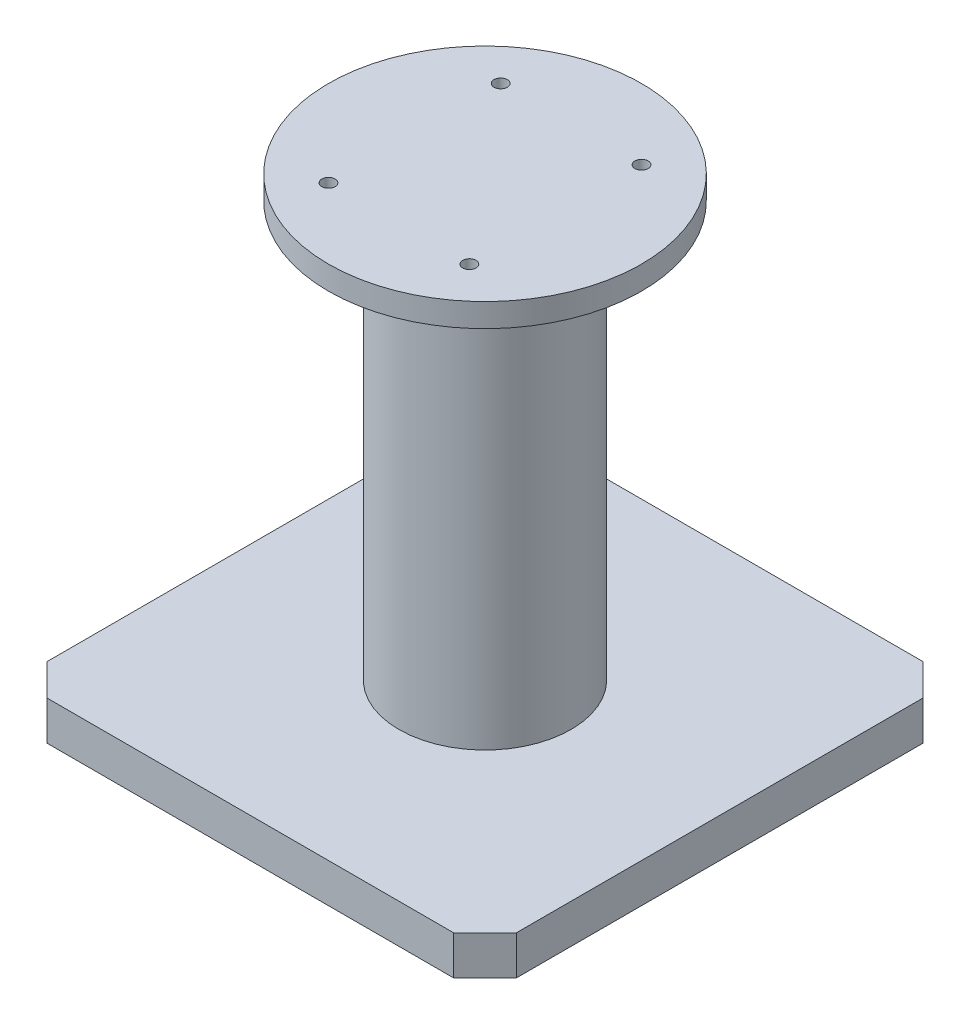
ISO-10303-21;
HEADER;
FILE_DESCRIPTION(('STEP AP214'),'2;1');
FILE_NAME('part.step','',(''),(''),'','','');
FILE_SCHEMA(('AUTOMOTIVE_DESIGN { 1 0 10303 214 1 1 1 1 }'));
ENDSEC;
DATA;
#1=APPLICATION_CONTEXT('core data for automotive mechanical design processes');
#2=APPLICATION_PROTOCOL_DEFINITION('international standard','automotive_design',2000,#1);
#3=PRODUCT_CONTEXT('',#1,'mechanical');
#4=PRODUCT('Part','Part','',(#3));
#5=PRODUCT_RELATED_PRODUCT_CATEGORY('part','',(#4));
#6=PRODUCT_DEFINITION_FORMATION('','',#4);
#7=PRODUCT_DEFINITION_CONTEXT('part definition',#1,'design');
#8=PRODUCT_DEFINITION('design','',#6,#7);
#9=PRODUCT_DEFINITION_SHAPE('','',#8);
#10=(LENGTH_UNIT() NAMED_UNIT(*) SI_UNIT(.MILLI.,.METRE.));
#11=(NAMED_UNIT(*) PLANE_ANGLE_UNIT() SI_UNIT($,.RADIAN.));
#12=(NAMED_UNIT(*) SI_UNIT($,.STERADIAN.) SOLID_ANGLE_UNIT());
#13=UNCERTAINTY_MEASURE_WITH_UNIT(LENGTH_MEASURE(1.E-05),#10,'distance_accuracy_value','');
#14=(GEOMETRIC_REPRESENTATION_CONTEXT(3) GLOBAL_UNCERTAINTY_ASSIGNED_CONTEXT((#13)) GLOBAL_UNIT_ASSIGNED_CONTEXT((#10,
#11,#12)) REPRESENTATION_CONTEXT('',''));
#15=CARTESIAN_POINT('',(0.,0.,0.));
#16=DIRECTION('',(0.,0.,1.));
#17=DIRECTION('',(1.,0.,0.));
#18=AXIS2_PLACEMENT_3D('',#15,#16,#17);
#19=CARTESIAN_POINT('',(0.,305.,0.));
#20=DIRECTION('',(0.,1.,0.));
#21=DIRECTION('',(0.,0.,1.));
#22=AXIS2_PLACEMENT_3D('',#19,#20,#21);
#23=PLANE('',#22);
#24=CARTESIAN_POINT('',(-45.,305.,55.));
#25=DIRECTION('',(0.,-1.,0.));
#26=DIRECTION('',(0.,0.,-1.));
#27=AXIS2_PLACEMENT_3D('',#24,#25,#26);
#28=CIRCLE('',#27,4.25000000000001);
#29=CARTESIAN_POINT('',(-45.,305.,50.75));
#30=VERTEX_POINT('',#29);
#31=EDGE_CURVE('E246',#30,#30,#28,.T.);
#32=ORIENTED_EDGE('',*,*,#31,.T.);
#33=EDGE_LOOP('',(#32));
#34=FACE_BOUND('',#33,.T.);
#35=CARTESIAN_POINT('',(-45.,305.,-55.));
#36=DIRECTION('',(0.,1.,0.));
#37=DIRECTION('',(0.,0.,1.));
#38=AXIS2_PLACEMENT_3D('',#35,#36,#37);
#39=CIRCLE('',#38,4.25000000000001);
#40=CARTESIAN_POINT('',(-45.,305.,-50.75));
#41=VERTEX_POINT('',#40);
#42=EDGE_CURVE('E230',#41,#41,#39,.T.);
#43=ORIENTED_EDGE('',*,*,#42,.F.);
#44=EDGE_LOOP('',(#43));
#45=FACE_BOUND('',#44,.T.);
#46=CARTESIAN_POINT('',(45.,305.,55.));
#47=DIRECTION('',(0.,1.,0.));
#48=DIRECTION('',(0.,0.,1.));
#49=AXIS2_PLACEMENT_3D('',#46,#47,#48);
#50=CIRCLE('',#49,4.25000000000001);
#51=CARTESIAN_POINT('',(45.,305.,59.25));
#52=VERTEX_POINT('',#51);
#53=EDGE_CURVE('E226',#52,#52,#50,.T.);
#54=ORIENTED_EDGE('',*,*,#53,.F.);
#55=EDGE_LOOP('',(#54));
#56=FACE_BOUND('',#55,.T.);
#57=CARTESIAN_POINT('',(0.,305.,0.));
#58=DIRECTION('',(0.,1.,0.));
#59=DIRECTION('',(0.,0.,1.));
#60=AXIS2_PLACEMENT_3D('',#57,#58,#59);
#61=CIRCLE('',#60,100.);
#62=CARTESIAN_POINT('',(0.,305.,100.));
#63=VERTEX_POINT('',#62);
#64=EDGE_CURVE('E217',#63,#63,#61,.T.);
#65=ORIENTED_EDGE('',*,*,#64,.T.);
#66=EDGE_LOOP('',(#65));
#67=FACE_BOUND('',#66,.T.);
#68=CARTESIAN_POINT('',(45.,305.,-55.));
#69=DIRECTION('',(0.,-1.,0.));
#70=DIRECTION('',(0.,0.,-1.));
#71=AXIS2_PLACEMENT_3D('',#68,#69,#70);
#72=CIRCLE('',#71,4.25000000000001);
#73=CARTESIAN_POINT('',(45.,305.,-59.25));
#74=VERTEX_POINT('',#73);
#75=EDGE_CURVE('E238',#74,#74,#72,.T.);
#76=ORIENTED_EDGE('',*,*,#75,.T.);
#77=EDGE_LOOP('',(#76));
#78=FACE_BOUND('',#77,.T.);
#79=ADVANCED_FACE('F39',(#34,#45,#56,#67,#78),#23,.T.);
#80=CARTESIAN_POINT('',(0.,290.,0.));
#81=DIRECTION('',(0.,1.,0.));
#82=DIRECTION('',(0.,0.,1.));
#83=AXIS2_PLACEMENT_3D('',#80,#81,#82);
#84=PLANE('',#83);
#85=CARTESIAN_POINT('',(-45.,290.,-55.));
#86=DIRECTION('',(0.,1.,0.));
#87=DIRECTION('',(0.,0.,1.));
#88=AXIS2_PLACEMENT_3D('',#85,#86,#87);
#89=CIRCLE('',#88,4.25000000000001);
#90=CARTESIAN_POINT('',(-45.,290.,-50.75));
#91=VERTEX_POINT('',#90);
#92=EDGE_CURVE('E250',#91,#91,#89,.T.);
#93=ORIENTED_EDGE('',*,*,#92,.T.);
#94=EDGE_LOOP('',(#93));
#95=FACE_BOUND('',#94,.T.);
#96=CARTESIAN_POINT('',(45.,290.,55.));
#97=DIRECTION('',(0.,1.,0.));
#98=DIRECTION('',(0.,0.,1.));
#99=AXIS2_PLACEMENT_3D('',#96,#97,#98);
#100=CIRCLE('',#99,4.25000000000001);
#101=CARTESIAN_POINT('',(45.,290.,59.25));
#102=VERTEX_POINT('',#101);
#103=EDGE_CURVE('E222',#102,#102,#100,.T.);
#104=ORIENTED_EDGE('',*,*,#103,.T.);
#105=EDGE_LOOP('',(#104));
#106=FACE_BOUND('',#105,.T.);
#107=CARTESIAN_POINT('',(0.,290.,0.));
#108=DIRECTION('',(0.,1.,0.));
#109=DIRECTION('',(0.,0.,1.));
#110=AXIS2_PLACEMENT_3D('',#107,#108,#109);
#111=CIRCLE('',#110,55.);
#112=CARTESIAN_POINT('',(0.,290.,55.));
#113=VERTEX_POINT('',#112);
#114=EDGE_CURVE('E148',#113,#113,#111,.T.);
#115=ORIENTED_EDGE('',*,*,#114,.T.);
#116=EDGE_LOOP('',(#115));
#117=FACE_BOUND('',#116,.T.);
#118=CARTESIAN_POINT('',(0.,290.,0.));
#119=DIRECTION('',(0.,1.,0.));
#120=DIRECTION('',(0.,0.,1.));
#121=AXIS2_PLACEMENT_3D('',#118,#119,#120);
#122=CIRCLE('',#121,100.);
#123=CARTESIAN_POINT('',(0.,290.,100.));
#124=VERTEX_POINT('',#123);
#125=EDGE_CURVE('E218',#124,#124,#122,.T.);
#126=ORIENTED_EDGE('',*,*,#125,.F.);
#127=EDGE_LOOP('',(#126));
#128=FACE_BOUND('',#127,.T.);
#129=CARTESIAN_POINT('',(-45.,290.,55.));
#130=DIRECTION('',(0.,-1.,0.));
#131=DIRECTION('',(0.,0.,-1.));
#132=AXIS2_PLACEMENT_3D('',#129,#130,#131);
#133=CIRCLE('',#132,4.25000000000001);
#134=CARTESIAN_POINT('',(-45.,290.,50.75));
#135=VERTEX_POINT('',#134);
#136=EDGE_CURVE('E242',#135,#135,#133,.T.);
#137=ORIENTED_EDGE('',*,*,#136,.F.);
#138=EDGE_LOOP('',(#137));
#139=FACE_BOUND('',#138,.T.);
#140=CARTESIAN_POINT('',(45.,290.,-55.));
#141=DIRECTION('',(0.,-1.,0.));
#142=DIRECTION('',(0.,0.,-1.));
#143=AXIS2_PLACEMENT_3D('',#140,#141,#142);
#144=CIRCLE('',#143,4.25000000000001);
#145=CARTESIAN_POINT('',(45.,290.,-59.25));
#146=VERTEX_POINT('',#145);
#147=EDGE_CURVE('E234',#146,#146,#144,.T.);
#148=ORIENTED_EDGE('',*,*,#147,.F.);
#149=EDGE_LOOP('',(#148));
#150=FACE_BOUND('',#149,.T.);
#151=ADVANCED_FACE('F262',(#95,#106,#117,#128,#139,#150),#84,.F.);
#152=CARTESIAN_POINT('',(-130.,25.,-150.));
#153=DIRECTION('',(0.,0.,1.));
#154=DIRECTION('',(1.,0.,0.));
#155=AXIS2_PLACEMENT_3D('',#152,#153,#154);
#156=PLANE('',#155);
#157=DIRECTION('',(-1.,0.,0.));
#158=VECTOR('',#157,1.);
#159=CARTESIAN_POINT('',(-130.,0.,-150.));
#160=LINE('',#159,#158);
#161=CARTESIAN_POINT('',(130.,0.,-150.));
#162=VERTEX_POINT('',#161);
#163=CARTESIAN_POINT('',(-130.,0.,-150.));
#164=VERTEX_POINT('',#163);
#165=EDGE_CURVE('E143',#162,#164,#160,.T.);
#166=ORIENTED_EDGE('',*,*,#165,.T.);
#167=DIRECTION('',(0.,-1.,0.));
#168=VECTOR('',#167,1.);
#169=CARTESIAN_POINT('',(-130.,25.,-150.));
#170=LINE('',#169,#168);
#171=CARTESIAN_POINT('',(-130.,25.,-150.));
#172=VERTEX_POINT('',#171);
#173=EDGE_CURVE('E43',#172,#164,#170,.T.);
#174=ORIENTED_EDGE('',*,*,#173,.F.);
#175=DIRECTION('',(-1.,0.,0.));
#176=VECTOR('',#175,1.);
#177=CARTESIAN_POINT('',(-130.,25.,-150.));
#178=LINE('',#177,#176);
#179=CARTESIAN_POINT('',(130.,25.,-150.));
#180=VERTEX_POINT('',#179);
#181=EDGE_CURVE('E166',#180,#172,#178,.T.);
#182=ORIENTED_EDGE('',*,*,#181,.F.);
#183=DIRECTION('',(0.,-1.,0.));
#184=VECTOR('',#183,1.);
#185=CARTESIAN_POINT('',(130.,25.,-150.));
#186=LINE('',#185,#184);
#187=EDGE_CURVE('E139',#180,#162,#186,.T.);
#188=ORIENTED_EDGE('',*,*,#187,.T.);
#189=EDGE_LOOP('',(#166,#174,#182,#188));
#190=FACE_BOUND('',#189,.T.);
#191=ADVANCED_FACE('F41',(#190),#156,.F.);
#192=CARTESIAN_POINT('',(-150.,25.,-130.));
#193=DIRECTION('',(0.707106781186547,0.,0.707106781186548));
#194=DIRECTION('',(0.707106781186548,0.,-0.707106781186547));
#195=AXIS2_PLACEMENT_3D('',#192,#193,#194);
#196=PLANE('',#195);
#197=DIRECTION('',(-0.707106781186549,0.,0.707106781186547));
#198=VECTOR('',#197,1.);
#199=CARTESIAN_POINT('',(-150.,0.,-130.));
#200=LINE('',#199,#198);
#201=CARTESIAN_POINT('',(-150.,0.,-130.));
#202=VERTEX_POINT('',#201);
#203=EDGE_CURVE('E147',#164,#202,#200,.T.);
#204=ORIENTED_EDGE('',*,*,#203,.T.);
#205=DIRECTION('',(0.,-1.,0.));
#206=VECTOR('',#205,1.);
#207=CARTESIAN_POINT('',(-150.,25.,-130.));
#208=LINE('',#207,#206);
#209=CARTESIAN_POINT('',(-150.,25.,-130.));
#210=VERTEX_POINT('',#209);
#211=EDGE_CURVE('E180',#210,#202,#208,.T.);
#212=ORIENTED_EDGE('',*,*,#211,.F.);
#213=DIRECTION('',(-0.707106781186549,0.,0.707106781186547));
#214=VECTOR('',#213,1.);
#215=CARTESIAN_POINT('',(-150.,25.,-130.));
#216=LINE('',#215,#214);
#217=EDGE_CURVE('E102',#172,#210,#216,.T.);
#218=ORIENTED_EDGE('',*,*,#217,.F.);
#219=ORIENTED_EDGE('',*,*,#173,.T.);
#220=EDGE_LOOP('',(#204,#212,#218,#219));
#221=FACE_BOUND('',#220,.T.);
#222=ADVANCED_FACE('F188',(#221),#196,.F.);
#223=CARTESIAN_POINT('',(-150.,25.,130.));
#224=DIRECTION('',(1.,0.,0.));
#225=DIRECTION('',(0.,0.,-1.));
#226=AXIS2_PLACEMENT_3D('',#223,#224,#225);
#227=PLANE('',#226);
#228=DIRECTION('',(0.,0.,1.));
#229=VECTOR('',#228,1.);
#230=CARTESIAN_POINT('',(-150.,0.,130.));
#231=LINE('',#230,#229);
#232=CARTESIAN_POINT('',(-150.,0.,130.));
#233=VERTEX_POINT('',#232);
#234=EDGE_CURVE('E151',#202,#233,#231,.T.);
#235=ORIENTED_EDGE('',*,*,#234,.T.);
#236=DIRECTION('',(0.,-1.,0.));
#237=VECTOR('',#236,1.);
#238=CARTESIAN_POINT('',(-150.,25.,130.));
#239=LINE('',#238,#237);
#240=CARTESIAN_POINT('',(-150.,25.,130.));
#241=VERTEX_POINT('',#240);
#242=EDGE_CURVE('E177',#241,#233,#239,.T.);
#243=ORIENTED_EDGE('',*,*,#242,.F.);
#244=DIRECTION('',(0.,0.,1.));
#245=VECTOR('',#244,1.);
#246=CARTESIAN_POINT('',(-150.,25.,130.));
#247=LINE('',#246,#245);
#248=EDGE_CURVE('E204',#210,#241,#247,.T.);
#249=ORIENTED_EDGE('',*,*,#248,.F.);
#250=ORIENTED_EDGE('',*,*,#211,.T.);
#251=EDGE_LOOP('',(#235,#243,#249,#250));
#252=FACE_BOUND('',#251,.T.);
#253=ADVANCED_FACE('F197',(#252),#227,.F.);
#254=CARTESIAN_POINT('',(-150.,25.,130.));
#255=DIRECTION('',(0.707106781186547,0.,-0.707106781186547));
#256=DIRECTION('',(-0.707106781186548,0.,-0.707106781186548));
#257=AXIS2_PLACEMENT_3D('',#254,#255,#256);
#258=PLANE('',#257);
#259=DIRECTION('',(0.707106781186547,0.,0.707106781186547));
#260=VECTOR('',#259,1.);
#261=CARTESIAN_POINT('',(-150.,0.,130.));
#262=LINE('',#261,#260);
#263=CARTESIAN_POINT('',(-130.,0.,150.));
#264=VERTEX_POINT('',#263);
#265=EDGE_CURVE('E154',#233,#264,#262,.T.);
#266=ORIENTED_EDGE('',*,*,#265,.T.);
#267=DIRECTION('',(0.,-1.,0.));
#268=VECTOR('',#267,1.);
#269=CARTESIAN_POINT('',(-130.,25.,150.));
#270=LINE('',#269,#268);
#271=CARTESIAN_POINT('',(-130.,25.,150.));
#272=VERTEX_POINT('',#271);
#273=EDGE_CURVE('E173',#272,#264,#270,.T.);
#274=ORIENTED_EDGE('',*,*,#273,.F.);
#275=DIRECTION('',(0.707106781186547,0.,0.707106781186547));
#276=VECTOR('',#275,1.);
#277=CARTESIAN_POINT('',(-150.,25.,130.));
#278=LINE('',#277,#276);
#279=EDGE_CURVE('E202',#241,#272,#278,.T.);
#280=ORIENTED_EDGE('',*,*,#279,.F.);
#281=ORIENTED_EDGE('',*,*,#242,.T.);
#282=EDGE_LOOP('',(#266,#274,#280,#281));
#283=FACE_BOUND('',#282,.T.);
#284=ADVANCED_FACE('F200',(#283),#258,.F.);
#285=CARTESIAN_POINT('',(-130.,25.,150.));
#286=DIRECTION('',(0.,0.,-1.));
#287=DIRECTION('',(-1.,0.,0.));
#288=AXIS2_PLACEMENT_3D('',#285,#286,#287);
#289=PLANE('',#288);
#290=DIRECTION('',(1.,0.,0.));
#291=VECTOR('',#290,1.);
#292=CARTESIAN_POINT('',(-130.,0.,150.));
#293=LINE('',#292,#291);
#294=CARTESIAN_POINT('',(130.,0.,150.));
#295=VERTEX_POINT('',#294);
#296=EDGE_CURVE('E157',#264,#295,#293,.T.);
#297=ORIENTED_EDGE('',*,*,#296,.T.);
#298=DIRECTION('',(0.,-1.,0.));
#299=VECTOR('',#298,1.);
#300=CARTESIAN_POINT('',(130.,25.,150.));
#301=LINE('',#300,#299);
#302=CARTESIAN_POINT('',(130.,25.,150.));
#303=VERTEX_POINT('',#302);
#304=EDGE_CURVE('E132',#303,#295,#301,.T.);
#305=ORIENTED_EDGE('',*,*,#304,.F.);
#306=DIRECTION('',(1.,0.,0.));
#307=VECTOR('',#306,1.);
#308=CARTESIAN_POINT('',(-130.,25.,150.));
#309=LINE('',#308,#307);
#310=EDGE_CURVE('E121',#272,#303,#309,.T.);
#311=ORIENTED_EDGE('',*,*,#310,.F.);
#312=ORIENTED_EDGE('',*,*,#273,.T.);
#313=EDGE_LOOP('',(#297,#305,#311,#312));
#314=FACE_BOUND('',#313,.T.);
#315=ADVANCED_FACE('F310',(#314),#289,.F.);
#316=CARTESIAN_POINT('',(130.,25.,150.));
#317=DIRECTION('',(-0.707106781186549,0.,-0.707106781186546));
#318=DIRECTION('',(-0.707106781186546,0.,0.707106781186549));
#319=AXIS2_PLACEMENT_3D('',#316,#317,#318);
#320=PLANE('',#319);
#321=DIRECTION('',(0.707106781186546,0.,-0.707106781186549));
#322=VECTOR('',#321,1.);
#323=CARTESIAN_POINT('',(130.,0.,150.));
#324=LINE('',#323,#322);
#325=CARTESIAN_POINT('',(150.,0.,130.));
#326=VERTEX_POINT('',#325);
#327=EDGE_CURVE('E130',#295,#326,#324,.T.);
#328=ORIENTED_EDGE('',*,*,#327,.T.);
#329=DIRECTION('',(0.,-1.,0.));
#330=VECTOR('',#329,1.);
#331=CARTESIAN_POINT('',(150.,25.,130.));
#332=LINE('',#331,#330);
#333=CARTESIAN_POINT('',(150.,25.,130.));
#334=VERTEX_POINT('',#333);
#335=EDGE_CURVE('E127',#334,#326,#332,.T.);
#336=ORIENTED_EDGE('',*,*,#335,.F.);
#337=DIRECTION('',(0.707106781186546,0.,-0.707106781186549));
#338=VECTOR('',#337,1.);
#339=CARTESIAN_POINT('',(130.,25.,150.));
#340=LINE('',#339,#338);
#341=EDGE_CURVE('E115',#303,#334,#340,.T.);
#342=ORIENTED_EDGE('',*,*,#341,.F.);
#343=ORIENTED_EDGE('',*,*,#304,.T.);
#344=EDGE_LOOP('',(#328,#336,#342,#343));
#345=FACE_BOUND('',#344,.T.);
#346=ADVANCED_FACE('F128',(#345),#320,.F.);
#347=CARTESIAN_POINT('',(150.,25.,130.));
#348=DIRECTION('',(-1.,0.,0.));
#349=DIRECTION('',(0.,0.,1.));
#350=AXIS2_PLACEMENT_3D('',#347,#348,#349);
#351=PLANE('',#350);
#352=DIRECTION('',(0.,0.,-1.));
#353=VECTOR('',#352,1.);
#354=CARTESIAN_POINT('',(150.,0.,130.));
#355=LINE('',#354,#353);
#356=CARTESIAN_POINT('',(150.,0.,-130.));
#357=VERTEX_POINT('',#356);
#358=EDGE_CURVE('E87',#326,#357,#355,.T.);
#359=ORIENTED_EDGE('',*,*,#358,.T.);
#360=DIRECTION('',(0.,-1.,0.));
#361=VECTOR('',#360,1.);
#362=CARTESIAN_POINT('',(150.,25.,-130.));
#363=LINE('',#362,#361);
#364=CARTESIAN_POINT('',(150.,25.,-130.));
#365=VERTEX_POINT('',#364);
#366=EDGE_CURVE('E133',#365,#357,#363,.T.);
#367=ORIENTED_EDGE('',*,*,#366,.F.);
#368=DIRECTION('',(0.,0.,-1.));
#369=VECTOR('',#368,1.);
#370=CARTESIAN_POINT('',(150.,25.,130.));
#371=LINE('',#370,#369);
#372=EDGE_CURVE('E119',#334,#365,#371,.T.);
#373=ORIENTED_EDGE('',*,*,#372,.F.);
#374=ORIENTED_EDGE('',*,*,#335,.T.);
#375=EDGE_LOOP('',(#359,#367,#373,#374));
#376=FACE_BOUND('',#375,.T.);
#377=ADVANCED_FACE('F135',(#376),#351,.F.);
#378=CARTESIAN_POINT('',(150.,25.,-130.));
#379=DIRECTION('',(-0.707106781186547,0.,0.707106781186548));
#380=DIRECTION('',(0.707106781186548,0.,0.707106781186547));
#381=AXIS2_PLACEMENT_3D('',#378,#379,#380);
#382=PLANE('',#381);
#383=DIRECTION('',(-0.707106781186548,0.,-0.707106781186547));
#384=VECTOR('',#383,1.);
#385=CARTESIAN_POINT('',(150.,0.,-130.));
#386=LINE('',#385,#384);
#387=EDGE_CURVE('E93',#357,#162,#386,.T.);
#388=ORIENTED_EDGE('',*,*,#387,.T.);
#389=ORIENTED_EDGE('',*,*,#187,.F.);
#390=DIRECTION('',(-0.707106781186548,0.,-0.707106781186547));
#391=VECTOR('',#390,1.);
#392=CARTESIAN_POINT('',(150.,25.,-130.));
#393=LINE('',#392,#391);
#394=EDGE_CURVE('E58',#365,#180,#393,.T.);
#395=ORIENTED_EDGE('',*,*,#394,.F.);
#396=ORIENTED_EDGE('',*,*,#366,.T.);
#397=EDGE_LOOP('',(#388,#389,#395,#396));
#398=FACE_BOUND('',#397,.T.);
#399=ADVANCED_FACE('F300',(#398),#382,.F.);
#400=CARTESIAN_POINT('',(0.,25.,0.));
#401=DIRECTION('',(0.,1.,0.));
#402=DIRECTION('',(0.,0.,1.));
#403=AXIS2_PLACEMENT_3D('',#400,#401,#402);
#404=PLANE('',#403);
#405=CARTESIAN_POINT('',(0.,25.,0.));
#406=DIRECTION('',(0.,1.,0.));
#407=DIRECTION('',(0.,0.,1.));
#408=AXIS2_PLACEMENT_3D('',#405,#406,#407);
#409=CIRCLE('',#408,55.);
#410=CARTESIAN_POINT('',(0.,25.,55.));
#411=VERTEX_POINT('',#410);
#412=EDGE_CURVE('E11',#411,#411,#409,.T.);
#413=ORIENTED_EDGE('',*,*,#412,.F.);
#414=EDGE_LOOP('',(#413));
#415=FACE_BOUND('',#414,.T.);
#416=ORIENTED_EDGE('',*,*,#181,.T.);
#417=ORIENTED_EDGE('',*,*,#217,.T.);
#418=ORIENTED_EDGE('',*,*,#248,.T.);
#419=ORIENTED_EDGE('',*,*,#279,.T.);
#420=ORIENTED_EDGE('',*,*,#310,.T.);
#421=ORIENTED_EDGE('',*,*,#341,.T.);
#422=ORIENTED_EDGE('',*,*,#372,.T.);
#423=ORIENTED_EDGE('',*,*,#394,.T.);
#424=EDGE_LOOP('',(#416,#417,#418,#419,#420,#421,#422,#423));
#425=FACE_BOUND('',#424,.T.);
#426=ADVANCED_FACE('F117',(#415,#425),#404,.T.);
#427=CARTESIAN_POINT('',(0.,0.,0.));
#428=DIRECTION('',(0.,1.,0.));
#429=DIRECTION('',(0.,0.,1.));
#430=AXIS2_PLACEMENT_3D('',#427,#428,#429);
#431=PLANE('',#430);
#432=ORIENTED_EDGE('',*,*,#165,.F.);
#433=ORIENTED_EDGE('',*,*,#387,.F.);
#434=ORIENTED_EDGE('',*,*,#358,.F.);
#435=ORIENTED_EDGE('',*,*,#327,.F.);
#436=ORIENTED_EDGE('',*,*,#296,.F.);
#437=ORIENTED_EDGE('',*,*,#265,.F.);
#438=ORIENTED_EDGE('',*,*,#234,.F.);
#439=ORIENTED_EDGE('',*,*,#203,.F.);
#440=EDGE_LOOP('',(#432,#433,#434,#435,#436,#437,#438,#439));
#441=FACE_BOUND('',#440,.T.);
#442=ADVANCED_FACE('F193',(#441),#431,.F.);
#443=CARTESIAN_POINT('',(0.,290.,0.));
#444=DIRECTION('',(0.,-1.,0.));
#445=DIRECTION('',(0.,0.,-1.));
#446=AXIS2_PLACEMENT_3D('',#443,#444,#445);
#447=CYLINDRICAL_SURFACE('',#446,55.);
#448=ORIENTED_EDGE('',*,*,#114,.F.);
#449=EDGE_LOOP('',(#448));
#450=FACE_BOUND('',#449,.T.);
#451=ORIENTED_EDGE('',*,*,#412,.T.);
#452=EDGE_LOOP('',(#451));
#453=FACE_BOUND('',#452,.T.);
#454=ADVANCED_FACE('F293',(#450,#453),#447,.T.);
#455=CARTESIAN_POINT('',(0.,305.,0.));
#456=DIRECTION('',(0.,-1.,0.));
#457=DIRECTION('',(0.,0.,-1.));
#458=AXIS2_PLACEMENT_3D('',#455,#456,#457);
#459=CYLINDRICAL_SURFACE('',#458,100.);
#460=ORIENTED_EDGE('',*,*,#64,.F.);
#461=EDGE_LOOP('',(#460));
#462=FACE_BOUND('',#461,.T.);
#463=ORIENTED_EDGE('',*,*,#125,.T.);
#464=EDGE_LOOP('',(#463));
#465=FACE_BOUND('',#464,.T.);
#466=ADVANCED_FACE('F285',(#462,#465),#459,.T.);
#467=CARTESIAN_POINT('',(45.,290.,55.));
#468=DIRECTION('',(0.,1.,0.));
#469=DIRECTION('',(0.,0.,1.));
#470=AXIS2_PLACEMENT_3D('',#467,#468,#469);
#471=CYLINDRICAL_SURFACE('',#470,4.25000000000001);
#472=ORIENTED_EDGE('',*,*,#103,.F.);
#473=EDGE_LOOP('',(#472));
#474=FACE_BOUND('',#473,.T.);
#475=ORIENTED_EDGE('',*,*,#53,.T.);
#476=EDGE_LOOP('',(#475));
#477=FACE_BOUND('',#476,.T.);
#478=ADVANCED_FACE('F283',(#474,#477),#471,.F.);
#479=CARTESIAN_POINT('',(-45.,290.,-55.));
#480=DIRECTION('',(0.,1.,0.));
#481=DIRECTION('',(0.,0.,1.));
#482=AXIS2_PLACEMENT_3D('',#479,#480,#481);
#483=CYLINDRICAL_SURFACE('',#482,4.25000000000001);
#484=ORIENTED_EDGE('',*,*,#92,.F.);
#485=EDGE_LOOP('',(#484));
#486=FACE_BOUND('',#485,.T.);
#487=ORIENTED_EDGE('',*,*,#42,.T.);
#488=EDGE_LOOP('',(#487));
#489=FACE_BOUND('',#488,.T.);
#490=ADVANCED_FACE('F258',(#486,#489),#483,.F.);
#491=CARTESIAN_POINT('',(-45.,290.,55.));
#492=DIRECTION('',(0.,1.,0.));
#493=DIRECTION('',(0.,0.,1.));
#494=AXIS2_PLACEMENT_3D('',#491,#492,#493);
#495=CYLINDRICAL_SURFACE('',#494,4.25000000000001);
#496=ORIENTED_EDGE('',*,*,#136,.T.);
#497=EDGE_LOOP('',(#496));
#498=FACE_BOUND('',#497,.T.);
#499=ORIENTED_EDGE('',*,*,#31,.F.);
#500=EDGE_LOOP('',(#499));
#501=FACE_BOUND('',#500,.T.);
#502=ADVANCED_FACE('F273',(#498,#501),#495,.F.);
#503=CARTESIAN_POINT('',(45.,290.,-55.));
#504=DIRECTION('',(0.,1.,0.));
#505=DIRECTION('',(0.,0.,1.));
#506=AXIS2_PLACEMENT_3D('',#503,#504,#505);
#507=CYLINDRICAL_SURFACE('',#506,4.25000000000001);
#508=ORIENTED_EDGE('',*,*,#147,.T.);
#509=EDGE_LOOP('',(#508));
#510=FACE_BOUND('',#509,.T.);
#511=ORIENTED_EDGE('',*,*,#75,.F.);
#512=EDGE_LOOP('',(#511));
#513=FACE_BOUND('',#512,.T.);
#514=ADVANCED_FACE('F271',(#510,#513),#507,.F.);
#515=CLOSED_SHELL('',(#79,#151,#191,#222,#253,#284,#315,#346,#377,#399,#426,#442,#454,#466,#478,
#490,#502,#514));
#516=MANIFOLD_SOLID_BREP('B2',#515);
#517=ADVANCED_BREP_SHAPE_REPRESENTATION('',(#18,#516),#14);
#518=SHAPE_DEFINITION_REPRESENTATION(#9,#517);
ENDSEC;
END-ISO-10303-21;
